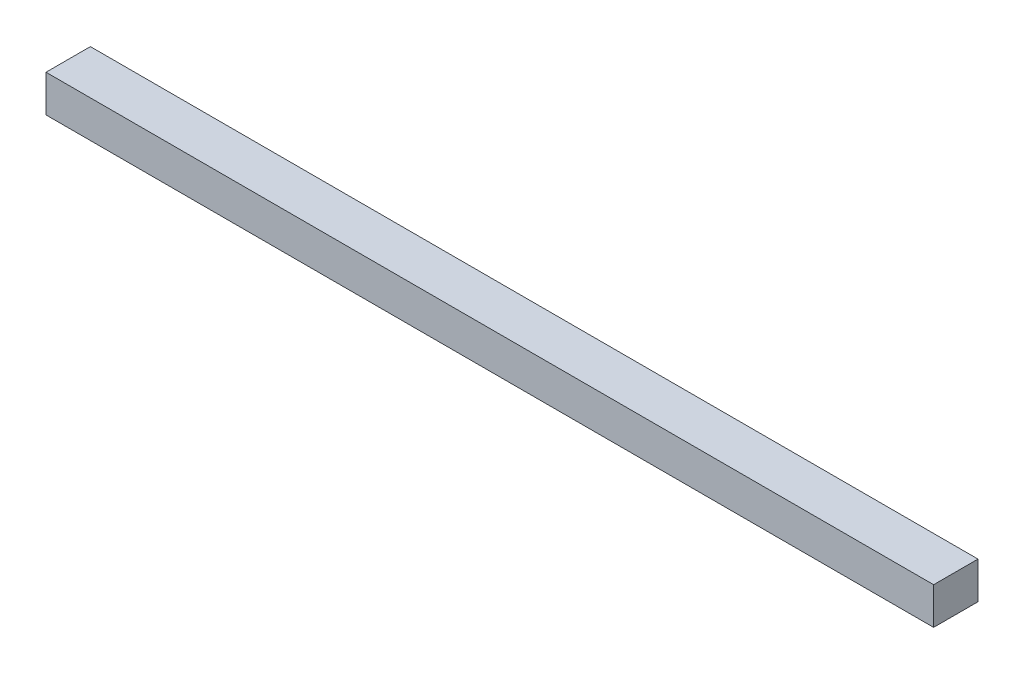
ISO-10303-21;
HEADER;
FILE_DESCRIPTION(('STEP AP214'),'2;1');
FILE_NAME('part.step','',(''),(''),'','','');
FILE_SCHEMA(('AUTOMOTIVE_DESIGN { 1 0 10303 214 1 1 1 1 }'));
ENDSEC;
DATA;
#1=APPLICATION_CONTEXT('core data for automotive mechanical design processes');
#2=APPLICATION_PROTOCOL_DEFINITION('international standard','automotive_design',2000,#1);
#3=PRODUCT_CONTEXT('',#1,'mechanical');
#4=PRODUCT('Part','Part','',(#3));
#5=PRODUCT_RELATED_PRODUCT_CATEGORY('part','',(#4));
#6=PRODUCT_DEFINITION_FORMATION('','',#4);
#7=PRODUCT_DEFINITION_CONTEXT('part definition',#1,'design');
#8=PRODUCT_DEFINITION('design','',#6,#7);
#9=PRODUCT_DEFINITION_SHAPE('','',#8);
#10=(LENGTH_UNIT() NAMED_UNIT(*) SI_UNIT(.MILLI.,.METRE.));
#11=(NAMED_UNIT(*) PLANE_ANGLE_UNIT() SI_UNIT($,.RADIAN.));
#12=(NAMED_UNIT(*) SI_UNIT($,.STERADIAN.) SOLID_ANGLE_UNIT());
#13=UNCERTAINTY_MEASURE_WITH_UNIT(LENGTH_MEASURE(1.E-05),#10,'distance_accuracy_value','');
#14=(GEOMETRIC_REPRESENTATION_CONTEXT(3) GLOBAL_UNCERTAINTY_ASSIGNED_CONTEXT((#13)) GLOBAL_UNIT_ASSIGNED_CONTEXT((#10,
#11,#12)) REPRESENTATION_CONTEXT('',''));
#15=CARTESIAN_POINT('',(0.,0.,0.));
#16=DIRECTION('',(0.,0.,1.));
#17=DIRECTION('',(1.,0.,0.));
#18=AXIS2_PLACEMENT_3D('',#15,#16,#17);
#19=CARTESIAN_POINT('',(600.,-12.5,-15.));
#20=DIRECTION('',(0.,0.,1.));
#21=DIRECTION('',(1.,0.,0.));
#22=AXIS2_PLACEMENT_3D('',#19,#20,#21);
#23=PLANE('',#22);
#24=DIRECTION('',(0.,1.,0.));
#25=VECTOR('',#24,1.);
#26=CARTESIAN_POINT('',(0.,-12.5,-15.));
#27=LINE('',#26,#25);
#28=CARTESIAN_POINT('',(0.,-12.5,-15.));
#29=VERTEX_POINT('',#28);
#30=CARTESIAN_POINT('',(0.,12.5,-15.));
#31=VERTEX_POINT('',#30);
#32=EDGE_CURVE('E100',#29,#31,#27,.T.);
#33=ORIENTED_EDGE('',*,*,#32,.T.);
#34=DIRECTION('',(-1.,0.,0.));
#35=VECTOR('',#34,1.);
#36=CARTESIAN_POINT('',(600.,12.5,-15.));
#37=LINE('',#36,#35);
#38=CARTESIAN_POINT('',(600.,12.5,-15.));
#39=VERTEX_POINT('',#38);
#40=EDGE_CURVE('E11',#39,#31,#37,.T.);
#41=ORIENTED_EDGE('',*,*,#40,.F.);
#42=DIRECTION('',(0.,1.,0.));
#43=VECTOR('',#42,1.);
#44=CARTESIAN_POINT('',(600.,-12.5,-15.));
#45=LINE('',#44,#43);
#46=CARTESIAN_POINT('',(600.,-12.5,-15.));
#47=VERTEX_POINT('',#46);
#48=EDGE_CURVE('E88',#47,#39,#45,.T.);
#49=ORIENTED_EDGE('',*,*,#48,.F.);
#50=DIRECTION('',(-1.,0.,0.));
#51=VECTOR('',#50,1.);
#52=CARTESIAN_POINT('',(600.,-12.5,-15.));
#53=LINE('',#52,#51);
#54=EDGE_CURVE('E96',#47,#29,#53,.T.);
#55=ORIENTED_EDGE('',*,*,#54,.T.);
#56=EDGE_LOOP('',(#33,#41,#49,#55));
#57=FACE_BOUND('',#56,.T.);
#58=ADVANCED_FACE('F37',(#57),#23,.F.);
#59=CARTESIAN_POINT('',(600.,12.5,15.));
#60=DIRECTION('',(0.,-1.,0.));
#61=DIRECTION('',(0.,0.,-1.));
#62=AXIS2_PLACEMENT_3D('',#59,#60,#61);
#63=PLANE('',#62);
#64=DIRECTION('',(0.,0.,1.));
#65=VECTOR('',#64,1.);
#66=CARTESIAN_POINT('',(0.,12.5,15.));
#67=LINE('',#66,#65);
#68=CARTESIAN_POINT('',(0.,12.5,15.));
#69=VERTEX_POINT('',#68);
#70=EDGE_CURVE('E92',#31,#69,#67,.T.);
#71=ORIENTED_EDGE('',*,*,#70,.T.);
#72=DIRECTION('',(-1.,0.,0.));
#73=VECTOR('',#72,1.);
#74=CARTESIAN_POINT('',(600.,12.5,15.));
#75=LINE('',#74,#73);
#76=CARTESIAN_POINT('',(600.,12.5,15.));
#77=VERTEX_POINT('',#76);
#78=EDGE_CURVE('E45',#77,#69,#75,.T.);
#79=ORIENTED_EDGE('',*,*,#78,.F.);
#80=DIRECTION('',(0.,0.,1.));
#81=VECTOR('',#80,1.);
#82=CARTESIAN_POINT('',(600.,12.5,15.));
#83=LINE('',#82,#81);
#84=EDGE_CURVE('E83',#39,#77,#83,.T.);
#85=ORIENTED_EDGE('',*,*,#84,.F.);
#86=ORIENTED_EDGE('',*,*,#40,.T.);
#87=EDGE_LOOP('',(#71,#79,#85,#86));
#88=FACE_BOUND('',#87,.T.);
#89=ADVANCED_FACE('F91',(#88),#63,.F.);
#90=CARTESIAN_POINT('',(600.,-12.5,15.));
#91=DIRECTION('',(0.,0.,-1.));
#92=DIRECTION('',(-1.,0.,0.));
#93=AXIS2_PLACEMENT_3D('',#90,#91,#92);
#94=PLANE('',#93);
#95=DIRECTION('',(0.,-1.,0.));
#96=VECTOR('',#95,1.);
#97=CARTESIAN_POINT('',(0.,-12.5,15.));
#98=LINE('',#97,#96);
#99=CARTESIAN_POINT('',(0.,-12.5,15.));
#100=VERTEX_POINT('',#99);
#101=EDGE_CURVE('E70',#69,#100,#98,.T.);
#102=ORIENTED_EDGE('',*,*,#101,.T.);
#103=DIRECTION('',(-1.,0.,0.));
#104=VECTOR('',#103,1.);
#105=CARTESIAN_POINT('',(600.,-12.5,15.));
#106=LINE('',#105,#104);
#107=CARTESIAN_POINT('',(600.,-12.5,15.));
#108=VERTEX_POINT('',#107);
#109=EDGE_CURVE('E93',#108,#100,#106,.T.);
#110=ORIENTED_EDGE('',*,*,#109,.F.);
#111=DIRECTION('',(0.,-1.,0.));
#112=VECTOR('',#111,1.);
#113=CARTESIAN_POINT('',(600.,-12.5,15.));
#114=LINE('',#113,#112);
#115=EDGE_CURVE('E86',#77,#108,#114,.T.);
#116=ORIENTED_EDGE('',*,*,#115,.F.);
#117=ORIENTED_EDGE('',*,*,#78,.T.);
#118=EDGE_LOOP('',(#102,#110,#116,#117));
#119=FACE_BOUND('',#118,.T.);
#120=ADVANCED_FACE('F94',(#119),#94,.F.);
#121=CARTESIAN_POINT('',(600.,-12.5,15.));
#122=DIRECTION('',(0.,1.,0.));
#123=DIRECTION('',(0.,0.,1.));
#124=AXIS2_PLACEMENT_3D('',#121,#122,#123);
#125=PLANE('',#124);
#126=DIRECTION('',(0.,0.,-1.));
#127=VECTOR('',#126,1.);
#128=CARTESIAN_POINT('',(0.,-12.5,15.));
#129=LINE('',#128,#127);
#130=EDGE_CURVE('E76',#100,#29,#129,.T.);
#131=ORIENTED_EDGE('',*,*,#130,.T.);
#132=ORIENTED_EDGE('',*,*,#54,.F.);
#133=DIRECTION('',(0.,0.,-1.));
#134=VECTOR('',#133,1.);
#135=CARTESIAN_POINT('',(600.,-12.5,15.));
#136=LINE('',#135,#134);
#137=EDGE_CURVE('E53',#108,#47,#136,.T.);
#138=ORIENTED_EDGE('',*,*,#137,.F.);
#139=ORIENTED_EDGE('',*,*,#109,.T.);
#140=EDGE_LOOP('',(#131,#132,#138,#139));
#141=FACE_BOUND('',#140,.T.);
#142=ADVANCED_FACE('F107',(#141),#125,.F.);
#143=CARTESIAN_POINT('',(600.,0.,0.));
#144=DIRECTION('',(-1.,0.,0.));
#145=DIRECTION('',(0.,0.,1.));
#146=AXIS2_PLACEMENT_3D('',#143,#144,#145);
#147=PLANE('',#146);
#148=ORIENTED_EDGE('',*,*,#48,.T.);
#149=ORIENTED_EDGE('',*,*,#84,.T.);
#150=ORIENTED_EDGE('',*,*,#115,.T.);
#151=ORIENTED_EDGE('',*,*,#137,.T.);
#152=EDGE_LOOP('',(#148,#149,#150,#151));
#153=FACE_BOUND('',#152,.T.);
#154=ADVANCED_FACE('F84',(#153),#147,.F.);
#155=CARTESIAN_POINT('',(0.,0.,0.));
#156=DIRECTION('',(-1.,0.,0.));
#157=DIRECTION('',(0.,0.,1.));
#158=AXIS2_PLACEMENT_3D('',#155,#156,#157);
#159=PLANE('',#158);
#160=ORIENTED_EDGE('',*,*,#32,.F.);
#161=ORIENTED_EDGE('',*,*,#130,.F.);
#162=ORIENTED_EDGE('',*,*,#101,.F.);
#163=ORIENTED_EDGE('',*,*,#70,.F.);
#164=EDGE_LOOP('',(#160,#161,#162,#163));
#165=FACE_BOUND('',#164,.T.);
#166=ADVANCED_FACE('F110',(#165),#159,.T.);
#167=CLOSED_SHELL('',(#58,#89,#120,#142,#154,#166));
#168=MANIFOLD_SOLID_BREP('B2',#167);
#169=ADVANCED_BREP_SHAPE_REPRESENTATION('',(#18,#168),#14);
#170=SHAPE_DEFINITION_REPRESENTATION(#9,#169);
ENDSEC;
END-ISO-10303-21;
